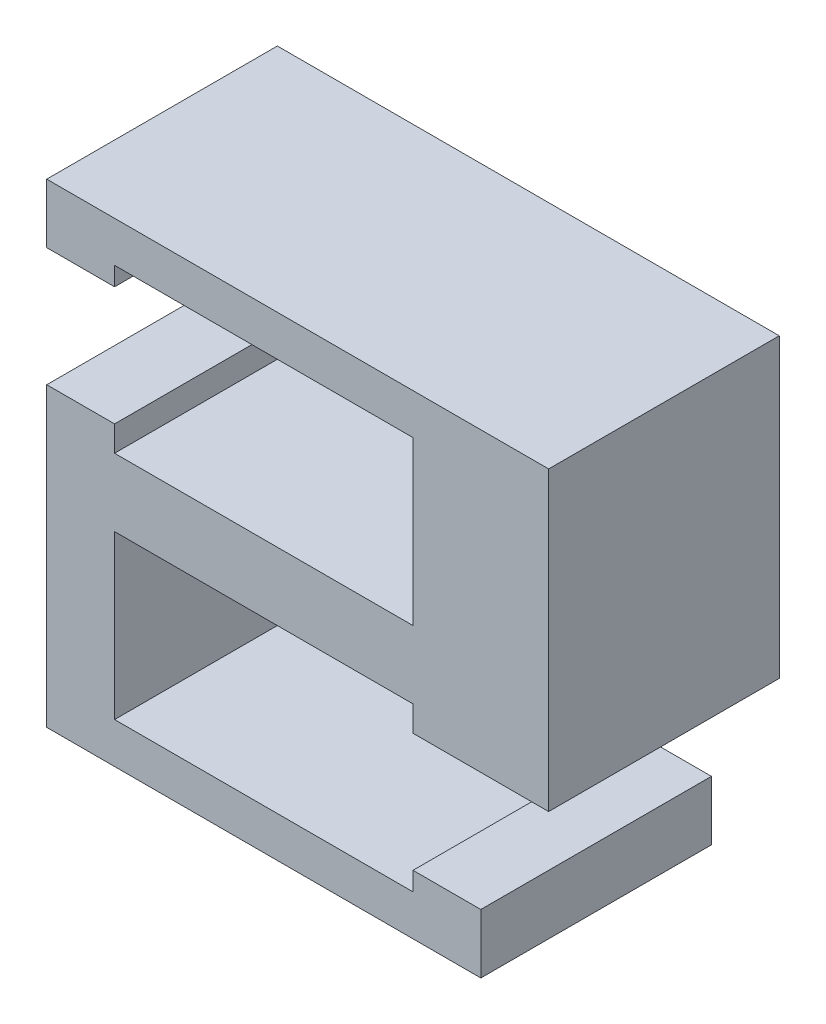
ISO-10303-21;
HEADER;
FILE_DESCRIPTION(('STEP AP214'),'2;1');
FILE_NAME('part.step','',(''),(''),'','','');
FILE_SCHEMA(('AUTOMOTIVE_DESIGN { 1 0 10303 214 1 1 1 1 }'));
ENDSEC;
DATA;
#1=APPLICATION_CONTEXT('core data for automotive mechanical design processes');
#2=APPLICATION_PROTOCOL_DEFINITION('international standard','automotive_design',2000,#1);
#3=PRODUCT_CONTEXT('',#1,'mechanical');
#4=PRODUCT('Part','Part','',(#3));
#5=PRODUCT_RELATED_PRODUCT_CATEGORY('part','',(#4));
#6=PRODUCT_DEFINITION_FORMATION('','',#4);
#7=PRODUCT_DEFINITION_CONTEXT('part definition',#1,'design');
#8=PRODUCT_DEFINITION('design','',#6,#7);
#9=PRODUCT_DEFINITION_SHAPE('','',#8);
#10=(LENGTH_UNIT() NAMED_UNIT(*) SI_UNIT(.MILLI.,.METRE.));
#11=(NAMED_UNIT(*) PLANE_ANGLE_UNIT() SI_UNIT($,.RADIAN.));
#12=(NAMED_UNIT(*) SI_UNIT($,.STERADIAN.) SOLID_ANGLE_UNIT());
#13=UNCERTAINTY_MEASURE_WITH_UNIT(LENGTH_MEASURE(1.E-05),#10,'distance_accuracy_value','');
#14=(GEOMETRIC_REPRESENTATION_CONTEXT(3) GLOBAL_UNCERTAINTY_ASSIGNED_CONTEXT((#13)) GLOBAL_UNIT_ASSIGNED_CONTEXT((#10,
#11,#12)) REPRESENTATION_CONTEXT('',''));
#15=CARTESIAN_POINT('',(0.,0.,0.));
#16=DIRECTION('',(0.,0.,1.));
#17=DIRECTION('',(1.,0.,0.));
#18=AXIS2_PLACEMENT_3D('',#15,#16,#17);
#19=CARTESIAN_POINT('',(16.1122382547684,0.,35.));
#20=DIRECTION('',(-1.,0.,0.));
#21=DIRECTION('',(0.,-1.,0.));
#22=AXIS2_PLACEMENT_3D('',#19,#20,#21);
#23=PLANE('',#22);
#24=DIRECTION('',(0.,0.,-1.));
#25=VECTOR('',#24,1.);
#26=CARTESIAN_POINT('',(16.1122382547684,40.9799365132959,35.));
#27=LINE('',#26,#25);
#28=CARTESIAN_POINT('',(16.1122382547684,40.9799365132959,32.));
#29=VERTEX_POINT('',#28);
#30=CARTESIAN_POINT('',(16.1122382547684,40.9799365132959,15.));
#31=VERTEX_POINT('',#30);
#32=EDGE_CURVE('E47',#29,#31,#27,.T.);
#33=ORIENTED_EDGE('',*,*,#32,.T.);
#34=DIRECTION('',(0.,1.,0.));
#35=VECTOR('',#34,1.);
#36=CARTESIAN_POINT('',(16.1122382547684,75.9799365132959,15.));
#37=LINE('',#36,#35);
#38=CARTESIAN_POINT('',(16.1122382547684,45.3549365132959,15.));
#39=VERTEX_POINT('',#38);
#40=EDGE_CURVE('E272',#31,#39,#37,.T.);
#41=ORIENTED_EDGE('',*,*,#40,.T.);
#42=DIRECTION('',(0.,0.,1.));
#43=VECTOR('',#42,1.);
#44=CARTESIAN_POINT('',(16.1122382547684,45.3549365132959,35.));
#45=LINE('',#44,#43);
#46=CARTESIAN_POINT('',(16.1122382547684,45.3549365132959,32.));
#47=VERTEX_POINT('',#46);
#48=EDGE_CURVE('E252',#39,#47,#45,.T.);
#49=ORIENTED_EDGE('',*,*,#48,.T.);
#50=DIRECTION('',(0.,1.,0.));
#51=VECTOR('',#50,1.);
#52=CARTESIAN_POINT('',(16.1122382547684,75.9799365132959,32.));
#53=LINE('',#52,#51);
#54=EDGE_CURVE('E210',#29,#47,#53,.T.);
#55=ORIENTED_EDGE('',*,*,#54,.F.);
#56=EDGE_LOOP('',(#33,#41,#49,#55));
#57=FACE_BOUND('',#56,.T.);
#58=ADVANCED_FACE('F39',(#57),#23,.F.);
#59=CARTESIAN_POINT('',(11.1122380163498,0.,35.));
#60=DIRECTION('',(-1.,0.,0.));
#61=DIRECTION('',(0.,0.,-1.));
#62=AXIS2_PLACEMENT_3D('',#59,#60,#61);
#63=PLANE('',#62);
#64=DIRECTION('',(0.,1.,0.));
#65=VECTOR('',#64,1.);
#66=CARTESIAN_POINT('',(11.1122380163498,0.,32.));
#67=LINE('',#66,#65);
#68=CARTESIAN_POINT('',(11.1122380163498,43.9799365132959,32.));
#69=VERTEX_POINT('',#68);
#70=CARTESIAN_POINT('',(11.1122380163498,45.3549365132959,32.));
#71=VERTEX_POINT('',#70);
#72=EDGE_CURVE('E219',#69,#71,#67,.T.);
#73=ORIENTED_EDGE('',*,*,#72,.T.);
#74=DIRECTION('',(0.,0.,1.));
#75=VECTOR('',#74,1.);
#76=CARTESIAN_POINT('',(11.1122380163498,45.3549365132959,35.));
#77=LINE('',#76,#75);
#78=CARTESIAN_POINT('',(11.1122380163498,45.3549365132959,15.));
#79=VERTEX_POINT('',#78);
#80=EDGE_CURVE('E253',#79,#71,#77,.T.);
#81=ORIENTED_EDGE('',*,*,#80,.F.);
#82=DIRECTION('',(0.,-1.,0.));
#83=VECTOR('',#82,1.);
#84=CARTESIAN_POINT('',(11.1122380163498,0.,15.));
#85=LINE('',#84,#83);
#86=CARTESIAN_POINT('',(11.1122380163498,43.9799365132959,15.));
#87=VERTEX_POINT('',#86);
#88=EDGE_CURVE('E288',#79,#87,#85,.T.);
#89=ORIENTED_EDGE('',*,*,#88,.T.);
#90=DIRECTION('',(0.,0.,-1.));
#91=VECTOR('',#90,1.);
#92=CARTESIAN_POINT('',(11.1122380163498,43.9799365132959,35.));
#93=LINE('',#92,#91);
#94=EDGE_CURVE('E329',#69,#87,#93,.T.);
#95=ORIENTED_EDGE('',*,*,#94,.F.);
#96=EDGE_LOOP('',(#73,#81,#89,#95));
#97=FACE_BOUND('',#96,.T.);
#98=ADVANCED_FACE('F355',(#97),#63,.T.);
#99=CARTESIAN_POINT('',(-10.8877619836502,0.,35.));
#100=DIRECTION('',(-1.,0.,0.));
#101=DIRECTION('',(0.,-1.,0.));
#102=AXIS2_PLACEMENT_3D('',#99,#100,#101);
#103=PLANE('',#102);
#104=DIRECTION('',(0.,0.,-1.));
#105=VECTOR('',#104,1.);
#106=CARTESIAN_POINT('',(-10.8877619836502,60.9799365132958,35.));
#107=LINE('',#106,#105);
#108=CARTESIAN_POINT('',(-10.8877619836502,60.9799365132958,32.));
#109=VERTEX_POINT('',#108);
#110=CARTESIAN_POINT('',(-10.8877619836502,60.9799365132959,15.));
#111=VERTEX_POINT('',#110);
#112=EDGE_CURVE('E318',#109,#111,#107,.T.);
#113=ORIENTED_EDGE('',*,*,#112,.T.);
#114=DIRECTION('',(0.,-1.,0.));
#115=VECTOR('',#114,1.);
#116=CARTESIAN_POINT('',(-10.8877619836502,0.,15.));
#117=LINE('',#116,#115);
#118=CARTESIAN_POINT('',(-10.8877619836502,62.8549365132958,15.));
#119=VERTEX_POINT('',#118);
#120=EDGE_CURVE('E306',#119,#111,#117,.T.);
#121=ORIENTED_EDGE('',*,*,#120,.F.);
#122=DIRECTION('',(0.,0.,-1.));
#123=VECTOR('',#122,1.);
#124=CARTESIAN_POINT('',(-10.8877619836502,62.8549365132958,15.));
#125=LINE('',#124,#123);
#126=CARTESIAN_POINT('',(-10.8877619836502,62.8549365132958,32.));
#127=VERTEX_POINT('',#126);
#128=EDGE_CURVE('E259',#127,#119,#125,.T.);
#129=ORIENTED_EDGE('',*,*,#128,.F.);
#130=DIRECTION('',(0.,1.,0.));
#131=VECTOR('',#130,1.);
#132=CARTESIAN_POINT('',(-10.8877619836502,0.,32.));
#133=LINE('',#132,#131);
#134=EDGE_CURVE('E237',#109,#127,#133,.T.);
#135=ORIENTED_EDGE('',*,*,#134,.F.);
#136=EDGE_LOOP('',(#113,#121,#129,#135));
#137=FACE_BOUND('',#136,.T.);
#138=ADVANCED_FACE('F378',(#137),#103,.F.);
#139=CARTESIAN_POINT('',(-15.8877622220688,0.,35.));
#140=DIRECTION('',(-1.,0.,0.));
#141=DIRECTION('',(0.,-1.,0.));
#142=AXIS2_PLACEMENT_3D('',#139,#140,#141);
#143=PLANE('',#142);
#144=DIRECTION('',(0.,1.,0.));
#145=VECTOR('',#144,1.);
#146=CARTESIAN_POINT('',(-15.8877622220688,75.9799365132959,32.));
#147=LINE('',#146,#145);
#148=CARTESIAN_POINT('',(-15.8877622220688,40.9799365132959,32.));
#149=VERTEX_POINT('',#148);
#150=CARTESIAN_POINT('',(-15.8877622220688,62.8549365132958,32.));
#151=VERTEX_POINT('',#150);
#152=EDGE_CURVE('E213',#149,#151,#147,.T.);
#153=ORIENTED_EDGE('',*,*,#152,.T.);
#154=DIRECTION('',(0.,0.,1.));
#155=VECTOR('',#154,1.);
#156=CARTESIAN_POINT('',(-15.8877622220688,62.8549365132958,15.));
#157=LINE('',#156,#155);
#158=CARTESIAN_POINT('',(-15.8877622220688,62.8549365132958,15.));
#159=VERTEX_POINT('',#158);
#160=EDGE_CURVE('E265',#159,#151,#157,.T.);
#161=ORIENTED_EDGE('',*,*,#160,.F.);
#162=DIRECTION('',(0.,1.,0.));
#163=VECTOR('',#162,1.);
#164=CARTESIAN_POINT('',(-15.8877622220688,75.9799365132959,15.));
#165=LINE('',#164,#163);
#166=CARTESIAN_POINT('',(-15.8877622220688,40.9799365132959,15.));
#167=VERTEX_POINT('',#166);
#168=EDGE_CURVE('E276',#167,#159,#165,.T.);
#169=ORIENTED_EDGE('',*,*,#168,.F.);
#170=DIRECTION('',(0.,0.,-1.));
#171=VECTOR('',#170,1.);
#172=CARTESIAN_POINT('',(-15.8877622220688,40.9799365132959,35.));
#173=LINE('',#172,#171);
#174=EDGE_CURVE('E313',#149,#167,#173,.T.);
#175=ORIENTED_EDGE('',*,*,#174,.F.);
#176=EDGE_LOOP('',(#153,#161,#169,#175));
#177=FACE_BOUND('',#176,.T.);
#178=ADVANCED_FACE('F368',(#177),#143,.T.);
#179=CARTESIAN_POINT('',(-15.8877622220688,75.9799365132959,15.));
#180=DIRECTION('',(0.,0.,1.));
#181=DIRECTION('',(0.,1.,0.));
#182=AXIS2_PLACEMENT_3D('',#179,#180,#181);
#183=PLANE('',#182);
#184=CARTESIAN_POINT('',(14.1122382547684,66.9799365132959,15.));
#185=DIRECTION('',(0.,0.,1.));
#186=DIRECTION('',(1.,0.,0.));
#187=AXIS2_PLACEMENT_3D('',#184,#185,#186);
#188=CIRCLE('',#187,0.999999999999961);
#189=CARTESIAN_POINT('',(15.1122382547684,66.9799365132959,15.));
#190=VERTEX_POINT('',#189);
#191=EDGE_CURVE('E200',#190,#190,#188,.T.);
#192=ORIENTED_EDGE('',*,*,#191,.T.);
#193=EDGE_LOOP('',(#192));
#194=FACE_BOUND('',#193,.T.);
#195=CARTESIAN_POINT('',(-13.8877622220688,49.9799365132959,15.));
#196=DIRECTION('',(0.,0.,1.));
#197=DIRECTION('',(1.,0.,0.));
#198=AXIS2_PLACEMENT_3D('',#195,#196,#197);
#199=CIRCLE('',#198,0.999999999999961);
#200=CARTESIAN_POINT('',(-12.8877622220688,49.9799365132959,15.));
#201=VERTEX_POINT('',#200);
#202=EDGE_CURVE('E203',#201,#201,#199,.T.);
#203=ORIENTED_EDGE('',*,*,#202,.T.);
#204=EDGE_LOOP('',(#203));
#205=FACE_BOUND('',#204,.T.);
#206=ORIENTED_EDGE('',*,*,#40,.F.);
#207=DIRECTION('',(1.,0.,0.));
#208=VECTOR('',#207,1.);
#209=CARTESIAN_POINT('',(-15.8877622220688,40.9799365132959,15.));
#210=LINE('',#209,#208);
#211=EDGE_CURVE('E282',#167,#31,#210,.T.);
#212=ORIENTED_EDGE('',*,*,#211,.F.);
#213=ORIENTED_EDGE('',*,*,#168,.T.);
#214=DIRECTION('',(-1.,0.,0.));
#215=VECTOR('',#214,1.);
#216=CARTESIAN_POINT('',(16.1132382547684,62.8549365132958,15.));
#217=LINE('',#216,#215);
#218=EDGE_CURVE('E268',#119,#159,#217,.T.);
#219=ORIENTED_EDGE('',*,*,#218,.F.);
#220=ORIENTED_EDGE('',*,*,#120,.T.);
#221=DIRECTION('',(1.,0.,0.));
#222=VECTOR('',#221,1.);
#223=CARTESIAN_POINT('',(0.,60.9799365132959,15.));
#224=LINE('',#223,#222);
#225=CARTESIAN_POINT('',(11.1122380163498,60.9799365132958,15.));
#226=VERTEX_POINT('',#225);
#227=EDGE_CURVE('E303',#111,#226,#224,.T.);
#228=ORIENTED_EDGE('',*,*,#227,.T.);
#229=DIRECTION('',(0.,-1.,0.));
#230=VECTOR('',#229,1.);
#231=CARTESIAN_POINT('',(11.1122380163498,0.,15.));
#232=LINE('',#231,#230);
#233=CARTESIAN_POINT('',(11.1122380163498,72.9799365132958,15.));
#234=VERTEX_POINT('',#233);
#235=EDGE_CURVE('E300',#234,#226,#232,.T.);
#236=ORIENTED_EDGE('',*,*,#235,.F.);
#237=DIRECTION('',(-1.,4.06395371900136E-09,0.));
#238=VECTOR('',#237,1.);
#239=CARTESIAN_POINT('',(2.96587084589218E-07,72.9799365584555,15.));
#240=LINE('',#239,#238);
#241=CARTESIAN_POINT('',(-10.8877619836502,72.9799366027028,15.));
#242=VERTEX_POINT('',#241);
#243=EDGE_CURVE('E297',#234,#242,#240,.T.);
#244=ORIENTED_EDGE('',*,*,#243,.T.);
#245=CARTESIAN_POINT('',(-10.8877619836502,71.6049365132959,15.));
#246=VERTEX_POINT('',#245);
#247=EDGE_CURVE('E307',#242,#246,#117,.T.);
#248=ORIENTED_EDGE('',*,*,#247,.T.);
#249=DIRECTION('',(-1.,0.,0.));
#250=VECTOR('',#249,1.);
#251=CARTESIAN_POINT('',(16.1132382547684,71.6049365132959,15.));
#252=LINE('',#251,#250);
#253=CARTESIAN_POINT('',(-15.8877622220688,71.6049365132959,15.));
#254=VERTEX_POINT('',#253);
#255=EDGE_CURVE('E264',#246,#254,#252,.T.);
#256=ORIENTED_EDGE('',*,*,#255,.T.);
#257=CARTESIAN_POINT('',(-15.8877622220688,75.9799365132959,15.));
#258=VERTEX_POINT('',#257);
#259=EDGE_CURVE('E279',#254,#258,#165,.T.);
#260=ORIENTED_EDGE('',*,*,#259,.T.);
#261=DIRECTION('',(1.,0.,0.));
#262=VECTOR('',#261,1.);
#263=CARTESIAN_POINT('',(-15.8877622220688,75.9799365132959,15.));
#264=LINE('',#263,#262);
#265=CARTESIAN_POINT('',(21.1122382547684,75.9799365132959,15.));
#266=VERTEX_POINT('',#265);
#267=EDGE_CURVE('E196',#258,#266,#264,.T.);
#268=ORIENTED_EDGE('',*,*,#267,.T.);
#269=DIRECTION('',(0.,-1.,0.));
#270=VECTOR('',#269,1.);
#271=CARTESIAN_POINT('',(21.1122382547684,75.9799365132959,15.));
#272=LINE('',#271,#270);
#273=CARTESIAN_POINT('',(21.1122382547684,54.1049365132959,15.));
#274=VERTEX_POINT('',#273);
#275=EDGE_CURVE('E180',#266,#274,#272,.T.);
#276=ORIENTED_EDGE('',*,*,#275,.T.);
#277=DIRECTION('',(1.,0.,0.));
#278=VECTOR('',#277,1.);
#279=CARTESIAN_POINT('',(-15.8887622220688,54.1049365132958,15.));
#280=LINE('',#279,#278);
#281=CARTESIAN_POINT('',(11.1122380163498,54.1049365132959,15.));
#282=VERTEX_POINT('',#281);
#283=EDGE_CURVE('E186',#282,#274,#280,.T.);
#284=ORIENTED_EDGE('',*,*,#283,.F.);
#285=CARTESIAN_POINT('',(11.1122380163498,55.9799365132959,15.));
#286=VERTEX_POINT('',#285);
#287=EDGE_CURVE('E289',#286,#282,#85,.T.);
#288=ORIENTED_EDGE('',*,*,#287,.F.);
#289=DIRECTION('',(-1.,0.,0.));
#290=VECTOR('',#289,1.);
#291=CARTESIAN_POINT('',(0.,55.9799365132959,15.));
#292=LINE('',#291,#290);
#293=CARTESIAN_POINT('',(-10.8877619836502,55.9799365132959,15.));
#294=VERTEX_POINT('',#293);
#295=EDGE_CURVE('E284',#286,#294,#292,.T.);
#296=ORIENTED_EDGE('',*,*,#295,.T.);
#297=DIRECTION('',(0.,-1.,0.));
#298=VECTOR('',#297,1.);
#299=CARTESIAN_POINT('',(-10.8877619836502,0.,15.));
#300=LINE('',#299,#298);
#301=CARTESIAN_POINT('',(-10.8877619836502,43.9799365132959,15.));
#302=VERTEX_POINT('',#301);
#303=EDGE_CURVE('E294',#294,#302,#300,.T.);
#304=ORIENTED_EDGE('',*,*,#303,.T.);
#305=DIRECTION('',(-1.,0.,0.));
#306=VECTOR('',#305,1.);
#307=CARTESIAN_POINT('',(0.,43.9799365132959,15.));
#308=LINE('',#307,#306);
#309=EDGE_CURVE('E291',#87,#302,#308,.T.);
#310=ORIENTED_EDGE('',*,*,#309,.F.);
#311=ORIENTED_EDGE('',*,*,#88,.F.);
#312=DIRECTION('',(1.,0.,0.));
#313=VECTOR('',#312,1.);
#314=CARTESIAN_POINT('',(-15.8887622220688,45.3549365132958,15.));
#315=LINE('',#314,#313);
#316=EDGE_CURVE('E190',#79,#39,#315,.T.);
#317=ORIENTED_EDGE('',*,*,#316,.T.);
#318=EDGE_LOOP('',(#206,#212,#213,#219,#220,#228,#236,#244,#248,#256,#260,#268,#276,#284,#288,
#296,#304,#310,#311,#317));
#319=FACE_BOUND('',#318,.T.);
#320=ADVANCED_FACE('F193',(#194,#205,#319),#183,.F.);
#321=CARTESIAN_POINT('',(0.,75.9799365132959,35.));
#322=DIRECTION('',(0.,1.,0.));
#323=DIRECTION('',(0.,0.,-1.));
#324=AXIS2_PLACEMENT_3D('',#321,#322,#323);
#325=PLANE('',#324);
#326=DIRECTION('',(-1.,0.,0.));
#327=VECTOR('',#326,1.);
#328=CARTESIAN_POINT('',(16.1122382547684,75.9799365132959,32.));
#329=LINE('',#328,#327);
#330=CARTESIAN_POINT('',(21.1122382547684,75.9799365132959,32.));
#331=VERTEX_POINT('',#330);
#332=CARTESIAN_POINT('',(-15.8877622220688,75.9799365132959,32.));
#333=VERTEX_POINT('',#332);
#334=EDGE_CURVE('E216',#331,#333,#329,.T.);
#335=ORIENTED_EDGE('',*,*,#334,.F.);
#336=DIRECTION('',(0.,0.,-1.));
#337=VECTOR('',#336,1.);
#338=CARTESIAN_POINT('',(21.1122382547684,75.9799365132959,15.));
#339=LINE('',#338,#337);
#340=EDGE_CURVE('E207',#331,#266,#339,.T.);
#341=ORIENTED_EDGE('',*,*,#340,.T.);
#342=ORIENTED_EDGE('',*,*,#267,.F.);
#343=DIRECTION('',(0.,0.,-1.));
#344=VECTOR('',#343,1.);
#345=CARTESIAN_POINT('',(-15.8877622220688,75.9799365132959,35.));
#346=LINE('',#345,#344);
#347=EDGE_CURVE('E316',#333,#258,#346,.T.);
#348=ORIENTED_EDGE('',*,*,#347,.F.);
#349=EDGE_LOOP('',(#335,#341,#342,#348));
#350=FACE_BOUND('',#349,.T.);
#351=ADVANCED_FACE('F404',(#350),#325,.T.);
#352=CARTESIAN_POINT('',(0.,40.9799365132959,35.));
#353=DIRECTION('',(0.,1.,0.));
#354=DIRECTION('',(0.,0.,-1.));
#355=AXIS2_PLACEMENT_3D('',#352,#353,#354);
#356=PLANE('',#355);
#357=ORIENTED_EDGE('',*,*,#174,.T.);
#358=ORIENTED_EDGE('',*,*,#211,.T.);
#359=ORIENTED_EDGE('',*,*,#32,.F.);
#360=DIRECTION('',(-1.,0.,0.));
#361=VECTOR('',#360,1.);
#362=CARTESIAN_POINT('',(16.1122382547684,40.9799365132959,32.));
#363=LINE('',#362,#361);
#364=EDGE_CURVE('E212',#29,#149,#363,.T.);
#365=ORIENTED_EDGE('',*,*,#364,.T.);
#366=EDGE_LOOP('',(#357,#358,#359,#365));
#367=FACE_BOUND('',#366,.T.);
#368=ADVANCED_FACE('F365',(#367),#356,.F.);
#369=DIRECTION('',(0.,0.,-1.));
#370=VECTOR('',#369,1.);
#371=CARTESIAN_POINT('',(-10.8877619836502,71.6049365132959,15.));
#372=LINE('',#371,#370);
#373=CARTESIAN_POINT('',(-10.8877619836502,71.6049365132959,32.));
#374=VERTEX_POINT('',#373);
#375=EDGE_CURVE('E263',#374,#246,#372,.T.);
#376=ORIENTED_EDGE('',*,*,#375,.T.);
#377=ORIENTED_EDGE('',*,*,#247,.F.);
#378=DIRECTION('',(0.,0.,-1.));
#379=VECTOR('',#378,1.);
#380=CARTESIAN_POINT('',(-10.8877619836502,72.9799366027028,35.));
#381=LINE('',#380,#379);
#382=CARTESIAN_POINT('',(-10.8877619836502,72.9799366027028,32.));
#383=VERTEX_POINT('',#382);
#384=EDGE_CURVE('E325',#383,#242,#381,.T.);
#385=ORIENTED_EDGE('',*,*,#384,.F.);
#386=DIRECTION('',(0.,1.,0.));
#387=VECTOR('',#386,1.);
#388=CARTESIAN_POINT('',(-10.8877619836502,0.,32.));
#389=LINE('',#388,#387);
#390=EDGE_CURVE('E247',#374,#383,#389,.T.);
#391=ORIENTED_EDGE('',*,*,#390,.F.);
#392=EDGE_LOOP('',(#376,#377,#385,#391));
#393=FACE_BOUND('',#392,.T.);
#394=ADVANCED_FACE('F393',(#393),#103,.F.);
#395=CARTESIAN_POINT('',(0.,60.9799365132959,35.));
#396=DIRECTION('',(0.,-1.,0.));
#397=DIRECTION('',(1.,0.,0.));
#398=AXIS2_PLACEMENT_3D('',#395,#396,#397);
#399=PLANE('',#398);
#400=DIRECTION('',(0.,0.,-1.));
#401=VECTOR('',#400,1.);
#402=CARTESIAN_POINT('',(11.1122380163498,60.9799365132958,35.));
#403=LINE('',#402,#401);
#404=CARTESIAN_POINT('',(11.1122380163498,60.9799365132958,32.));
#405=VERTEX_POINT('',#404);
#406=EDGE_CURVE('E321',#405,#226,#403,.T.);
#407=ORIENTED_EDGE('',*,*,#406,.T.);
#408=ORIENTED_EDGE('',*,*,#227,.F.);
#409=ORIENTED_EDGE('',*,*,#112,.F.);
#410=DIRECTION('',(-1.,0.,0.));
#411=VECTOR('',#410,1.);
#412=CARTESIAN_POINT('',(0.,60.9799365132959,32.));
#413=LINE('',#412,#411);
#414=EDGE_CURVE('E240',#405,#109,#413,.T.);
#415=ORIENTED_EDGE('',*,*,#414,.F.);
#416=EDGE_LOOP('',(#407,#408,#409,#415));
#417=FACE_BOUND('',#416,.T.);
#418=ADVANCED_FACE('F381',(#417),#399,.F.);
#419=DIRECTION('',(0.,1.,0.));
#420=VECTOR('',#419,1.);
#421=CARTESIAN_POINT('',(11.1122380163498,0.,32.));
#422=LINE('',#421,#420);
#423=CARTESIAN_POINT('',(11.1122380163498,72.9799365132958,32.));
#424=VERTEX_POINT('',#423);
#425=EDGE_CURVE('E242',#405,#424,#422,.T.);
#426=ORIENTED_EDGE('',*,*,#425,.T.);
#427=DIRECTION('',(0.,0.,-1.));
#428=VECTOR('',#427,1.);
#429=CARTESIAN_POINT('',(11.1122380163498,72.9799365132958,35.));
#430=LINE('',#429,#428);
#431=EDGE_CURVE('E323',#424,#234,#430,.T.);
#432=ORIENTED_EDGE('',*,*,#431,.T.);
#433=ORIENTED_EDGE('',*,*,#235,.T.);
#434=ORIENTED_EDGE('',*,*,#406,.F.);
#435=EDGE_LOOP('',(#426,#432,#433,#434));
#436=FACE_BOUND('',#435,.T.);
#437=ADVANCED_FACE('F384',(#436),#63,.T.);
#438=DIRECTION('',(0.,0.,-1.));
#439=VECTOR('',#438,1.);
#440=CARTESIAN_POINT('',(-10.8877619836502,43.9799365132959,35.));
#441=LINE('',#440,#439);
#442=CARTESIAN_POINT('',(-10.8877619836502,43.9799365132959,32.));
#443=VERTEX_POINT('',#442);
#444=EDGE_CURVE('E327',#443,#302,#441,.T.);
#445=ORIENTED_EDGE('',*,*,#444,.T.);
#446=ORIENTED_EDGE('',*,*,#303,.F.);
#447=DIRECTION('',(0.,0.,-1.));
#448=VECTOR('',#447,1.);
#449=CARTESIAN_POINT('',(-10.8877619836502,55.9799365132959,35.));
#450=LINE('',#449,#448);
#451=CARTESIAN_POINT('',(-10.8877619836502,55.9799365132959,32.));
#452=VERTEX_POINT('',#451);
#453=EDGE_CURVE('E310',#452,#294,#450,.T.);
#454=ORIENTED_EDGE('',*,*,#453,.F.);
#455=DIRECTION('',(0.,1.,0.));
#456=VECTOR('',#455,1.);
#457=CARTESIAN_POINT('',(-10.8877619836502,0.,32.));
#458=LINE('',#457,#456);
#459=EDGE_CURVE('E225',#443,#452,#458,.T.);
#460=ORIENTED_EDGE('',*,*,#459,.F.);
#461=EDGE_LOOP('',(#445,#446,#454,#460));
#462=FACE_BOUND('',#461,.T.);
#463=ADVANCED_FACE('F340',(#462),#103,.F.);
#464=CARTESIAN_POINT('',(0.,43.9799365132959,35.));
#465=DIRECTION('',(0.,1.,0.));
#466=DIRECTION('',(0.,0.,-1.));
#467=AXIS2_PLACEMENT_3D('',#464,#465,#466);
#468=PLANE('',#467);
#469=DIRECTION('',(1.,0.,0.));
#470=VECTOR('',#469,1.);
#471=CARTESIAN_POINT('',(0.,43.9799365132959,32.));
#472=LINE('',#471,#470);
#473=EDGE_CURVE('E223',#443,#69,#472,.T.);
#474=ORIENTED_EDGE('',*,*,#473,.T.);
#475=ORIENTED_EDGE('',*,*,#94,.T.);
#476=ORIENTED_EDGE('',*,*,#309,.T.);
#477=ORIENTED_EDGE('',*,*,#444,.F.);
#478=EDGE_LOOP('',(#474,#475,#476,#477));
#479=FACE_BOUND('',#478,.T.);
#480=ADVANCED_FACE('F348',(#479),#468,.T.);
#481=DIRECTION('',(0.,1.,0.));
#482=VECTOR('',#481,1.);
#483=CARTESIAN_POINT('',(11.1122380163498,0.,32.));
#484=LINE('',#483,#482);
#485=CARTESIAN_POINT('',(11.1122380163498,54.1049365132959,32.));
#486=VERTEX_POINT('',#485);
#487=CARTESIAN_POINT('',(11.1122380163498,55.9799365132959,32.));
#488=VERTEX_POINT('',#487);
#489=EDGE_CURVE('E230',#486,#488,#484,.T.);
#490=ORIENTED_EDGE('',*,*,#489,.T.);
#491=DIRECTION('',(0.,0.,-1.));
#492=VECTOR('',#491,1.);
#493=CARTESIAN_POINT('',(11.1122380163498,55.9799365132959,35.));
#494=LINE('',#493,#492);
#495=EDGE_CURVE('E332',#488,#286,#494,.T.);
#496=ORIENTED_EDGE('',*,*,#495,.T.);
#497=ORIENTED_EDGE('',*,*,#287,.T.);
#498=DIRECTION('',(0.,0.,-1.));
#499=VECTOR('',#498,1.);
#500=CARTESIAN_POINT('',(11.1122380163498,54.1049365132959,35.));
#501=LINE('',#500,#499);
#502=EDGE_CURVE('E60',#486,#282,#501,.T.);
#503=ORIENTED_EDGE('',*,*,#502,.F.);
#504=EDGE_LOOP('',(#490,#496,#497,#503));
#505=FACE_BOUND('',#504,.T.);
#506=ADVANCED_FACE('F343',(#505),#63,.T.);
#507=CARTESIAN_POINT('',(2.96587084589218E-07,72.9799365584555,35.));
#508=DIRECTION('',(4.06395371900136E-09,1.,0.));
#509=DIRECTION('',(-1.,4.06395371900136E-09,0.));
#510=AXIS2_PLACEMENT_3D('',#507,#508,#509);
#511=PLANE('',#510);
#512=ORIENTED_EDGE('',*,*,#384,.T.);
#513=ORIENTED_EDGE('',*,*,#243,.F.);
#514=ORIENTED_EDGE('',*,*,#431,.F.);
#515=DIRECTION('',(1.,-4.06395371900136E-09,0.));
#516=VECTOR('',#515,1.);
#517=CARTESIAN_POINT('',(2.96587084589218E-07,72.9799365584555,32.));
#518=LINE('',#517,#516);
#519=EDGE_CURVE('E245',#383,#424,#518,.T.);
#520=ORIENTED_EDGE('',*,*,#519,.F.);
#521=EDGE_LOOP('',(#512,#513,#514,#520));
#522=FACE_BOUND('',#521,.T.);
#523=ADVANCED_FACE('F389',(#522),#511,.F.);
#524=CARTESIAN_POINT('',(0.,55.9799365132959,35.));
#525=DIRECTION('',(0.,1.,0.));
#526=DIRECTION('',(0.,0.,-1.));
#527=AXIS2_PLACEMENT_3D('',#524,#525,#526);
#528=PLANE('',#527);
#529=ORIENTED_EDGE('',*,*,#453,.T.);
#530=ORIENTED_EDGE('',*,*,#295,.F.);
#531=ORIENTED_EDGE('',*,*,#495,.F.);
#532=DIRECTION('',(1.,0.,0.));
#533=VECTOR('',#532,1.);
#534=CARTESIAN_POINT('',(0.,55.9799365132959,32.));
#535=LINE('',#534,#533);
#536=EDGE_CURVE('E228',#452,#488,#535,.T.);
#537=ORIENTED_EDGE('',*,*,#536,.F.);
#538=EDGE_LOOP('',(#529,#530,#531,#537));
#539=FACE_BOUND('',#538,.T.);
#540=ADVANCED_FACE('F41',(#539),#528,.F.);
#541=CARTESIAN_POINT('',(-15.8877622220688,71.6049365132959,32.));
#542=VERTEX_POINT('',#541);
#543=EDGE_CURVE('E209',#542,#333,#147,.T.);
#544=ORIENTED_EDGE('',*,*,#543,.T.);
#545=ORIENTED_EDGE('',*,*,#347,.T.);
#546=ORIENTED_EDGE('',*,*,#259,.F.);
#547=DIRECTION('',(0.,0.,1.));
#548=VECTOR('',#547,1.);
#549=CARTESIAN_POINT('',(-15.8877622220688,71.6049365132959,15.));
#550=LINE('',#549,#548);
#551=EDGE_CURVE('E260',#254,#542,#550,.T.);
#552=ORIENTED_EDGE('',*,*,#551,.T.);
#553=EDGE_LOOP('',(#544,#545,#546,#552));
#554=FACE_BOUND('',#553,.T.);
#555=ADVANCED_FACE('F400',(#554),#143,.T.);
#556=CARTESIAN_POINT('',(16.1132382547684,71.6049365132959,15.));
#557=DIRECTION('',(0.,1.,0.));
#558=DIRECTION('',(-1.,0.,0.));
#559=AXIS2_PLACEMENT_3D('',#556,#557,#558);
#560=PLANE('',#559);
#561=ORIENTED_EDGE('',*,*,#551,.F.);
#562=ORIENTED_EDGE('',*,*,#255,.F.);
#563=ORIENTED_EDGE('',*,*,#375,.F.);
#564=DIRECTION('',(1.,0.,0.));
#565=VECTOR('',#564,1.);
#566=CARTESIAN_POINT('',(16.1132382547684,71.6049365132959,32.));
#567=LINE('',#566,#565);
#568=EDGE_CURVE('E250',#542,#374,#567,.T.);
#569=ORIENTED_EDGE('',*,*,#568,.F.);
#570=EDGE_LOOP('',(#561,#562,#563,#569));
#571=FACE_BOUND('',#570,.T.);
#572=ADVANCED_FACE('F397',(#571),#560,.F.);
#573=CARTESIAN_POINT('',(16.1132382547684,62.8549365132958,15.));
#574=DIRECTION('',(0.,1.,0.));
#575=DIRECTION('',(-1.,0.,0.));
#576=AXIS2_PLACEMENT_3D('',#573,#574,#575);
#577=PLANE('',#576);
#578=DIRECTION('',(1.,0.,0.));
#579=VECTOR('',#578,1.);
#580=CARTESIAN_POINT('',(16.1132382547684,62.8549365132958,32.));
#581=LINE('',#580,#579);
#582=EDGE_CURVE('E235',#151,#127,#581,.T.);
#583=ORIENTED_EDGE('',*,*,#582,.T.);
#584=ORIENTED_EDGE('',*,*,#128,.T.);
#585=ORIENTED_EDGE('',*,*,#218,.T.);
#586=ORIENTED_EDGE('',*,*,#160,.T.);
#587=EDGE_LOOP('',(#583,#584,#585,#586));
#588=FACE_BOUND('',#587,.T.);
#589=ADVANCED_FACE('F370',(#588),#577,.T.);
#590=CARTESIAN_POINT('',(-15.8887622220688,54.1049365132958,35.));
#591=DIRECTION('',(0.,1.,0.));
#592=DIRECTION('',(-1.,0.,0.));
#593=AXIS2_PLACEMENT_3D('',#590,#591,#592);
#594=PLANE('',#593);
#595=ORIENTED_EDGE('',*,*,#502,.T.);
#596=ORIENTED_EDGE('',*,*,#283,.T.);
#597=DIRECTION('',(0.,0.,1.));
#598=VECTOR('',#597,1.);
#599=CARTESIAN_POINT('',(21.1122382547684,54.1049365132959,15.));
#600=LINE('',#599,#598);
#601=CARTESIAN_POINT('',(21.1122382547684,54.1049365132959,32.));
#602=VERTEX_POINT('',#601);
#603=EDGE_CURVE('E176',#274,#602,#600,.T.);
#604=ORIENTED_EDGE('',*,*,#603,.T.);
#605=DIRECTION('',(1.,0.,0.));
#606=VECTOR('',#605,1.);
#607=CARTESIAN_POINT('',(-15.8887622220688,54.1049365132958,32.));
#608=LINE('',#607,#606);
#609=EDGE_CURVE('E233',#486,#602,#608,.T.);
#610=ORIENTED_EDGE('',*,*,#609,.F.);
#611=EDGE_LOOP('',(#595,#596,#604,#610));
#612=FACE_BOUND('',#611,.T.);
#613=ADVANCED_FACE('F187',(#612),#594,.F.);
#614=CARTESIAN_POINT('',(-15.8887622220688,45.3549365132958,35.));
#615=DIRECTION('',(0.,-1.,0.));
#616=DIRECTION('',(1.,0.,0.));
#617=AXIS2_PLACEMENT_3D('',#614,#615,#616);
#618=PLANE('',#617);
#619=ORIENTED_EDGE('',*,*,#48,.F.);
#620=ORIENTED_EDGE('',*,*,#316,.F.);
#621=ORIENTED_EDGE('',*,*,#80,.T.);
#622=DIRECTION('',(-1.,0.,0.));
#623=VECTOR('',#622,1.);
#624=CARTESIAN_POINT('',(-15.8887622220688,45.3549365132958,32.));
#625=LINE('',#624,#623);
#626=EDGE_CURVE('E11',#47,#71,#625,.T.);
#627=ORIENTED_EDGE('',*,*,#626,.F.);
#628=EDGE_LOOP('',(#619,#620,#621,#627));
#629=FACE_BOUND('',#628,.T.);
#630=ADVANCED_FACE('F357',(#629),#618,.F.);
#631=CARTESIAN_POINT('',(16.1122382547684,75.9799365132959,32.));
#632=DIRECTION('',(0.,0.,-1.));
#633=DIRECTION('',(0.,-1.,0.));
#634=AXIS2_PLACEMENT_3D('',#631,#632,#633);
#635=PLANE('',#634);
#636=ORIENTED_EDGE('',*,*,#543,.F.);
#637=ORIENTED_EDGE('',*,*,#568,.T.);
#638=ORIENTED_EDGE('',*,*,#390,.T.);
#639=ORIENTED_EDGE('',*,*,#519,.T.);
#640=ORIENTED_EDGE('',*,*,#425,.F.);
#641=ORIENTED_EDGE('',*,*,#414,.T.);
#642=ORIENTED_EDGE('',*,*,#134,.T.);
#643=ORIENTED_EDGE('',*,*,#582,.F.);
#644=ORIENTED_EDGE('',*,*,#152,.F.);
#645=ORIENTED_EDGE('',*,*,#364,.F.);
#646=ORIENTED_EDGE('',*,*,#54,.T.);
#647=ORIENTED_EDGE('',*,*,#626,.T.);
#648=ORIENTED_EDGE('',*,*,#72,.F.);
#649=ORIENTED_EDGE('',*,*,#473,.F.);
#650=ORIENTED_EDGE('',*,*,#459,.T.);
#651=ORIENTED_EDGE('',*,*,#536,.T.);
#652=ORIENTED_EDGE('',*,*,#489,.F.);
#653=ORIENTED_EDGE('',*,*,#609,.T.);
#654=DIRECTION('',(0.,1.,0.));
#655=VECTOR('',#654,1.);
#656=CARTESIAN_POINT('',(21.1122382547684,75.9799365132959,32.));
#657=LINE('',#656,#655);
#658=EDGE_CURVE('E182',#602,#331,#657,.T.);
#659=ORIENTED_EDGE('',*,*,#658,.T.);
#660=ORIENTED_EDGE('',*,*,#334,.T.);
#661=EDGE_LOOP('',(#636,#637,#638,#639,#640,#641,#642,#643,#644,#645,#646,#647,#648,#649,#650,
#651,#652,#653,#659,#660));
#662=FACE_BOUND('',#661,.T.);
#663=ADVANCED_FACE('F346',(#662),#635,.F.);
#664=CARTESIAN_POINT('',(21.1122382547684,0.,0.));
#665=DIRECTION('',(1.,0.,0.));
#666=DIRECTION('',(0.,1.,0.));
#667=AXIS2_PLACEMENT_3D('',#664,#665,#666);
#668=PLANE('',#667);
#669=ORIENTED_EDGE('',*,*,#275,.F.);
#670=ORIENTED_EDGE('',*,*,#340,.F.);
#671=ORIENTED_EDGE('',*,*,#658,.F.);
#672=ORIENTED_EDGE('',*,*,#603,.F.);
#673=EDGE_LOOP('',(#669,#670,#671,#672));
#674=FACE_BOUND('',#673,.T.);
#675=ADVANCED_FACE('F177',(#674),#668,.T.);
#676=CARTESIAN_POINT('',(-13.8877622220688,49.9799365132959,25.));
#677=DIRECTION('',(0.,0.,-1.));
#678=DIRECTION('',(1.,0.,0.));
#679=AXIS2_PLACEMENT_3D('',#676,#677,#678);
#680=CYLINDRICAL_SURFACE('',#679,0.999999999999961);
#681=CARTESIAN_POINT('',(-13.8877622220688,49.9799365132959,25.));
#682=DIRECTION('',(0.,0.,1.));
#683=DIRECTION('',(1.,0.,0.));
#684=AXIS2_PLACEMENT_3D('',#681,#682,#683);
#685=CIRCLE('',#684,0.999999999999961);
#686=CARTESIAN_POINT('',(-12.8877622220688,49.9799365132959,25.));
#687=VERTEX_POINT('',#686);
#688=EDGE_CURVE('E630',#687,#687,#685,.T.);
#689=ORIENTED_EDGE('',*,*,#688,.T.);
#690=EDGE_LOOP('',(#689));
#691=FACE_BOUND('',#690,.T.);
#692=ORIENTED_EDGE('',*,*,#202,.F.);
#693=EDGE_LOOP('',(#692));
#694=FACE_BOUND('',#693,.T.);
#695=ADVANCED_FACE('F579',(#691,#694),#680,.F.);
#696=CARTESIAN_POINT('',(-13.8877622220688,49.9799365132959,25.));
#697=DIRECTION('',(0.,0.,-1.));
#698=DIRECTION('',(1.,0.,0.));
#699=AXIS2_PLACEMENT_3D('',#696,#697,#698);
#700=PLANE('',#699);
#701=ORIENTED_EDGE('',*,*,#688,.F.);
#702=EDGE_LOOP('',(#701));
#703=FACE_BOUND('',#702,.T.);
#704=ADVANCED_FACE('F587',(#703),#700,.T.);
#705=CARTESIAN_POINT('',(14.1122382547684,66.9799365132959,25.));
#706=DIRECTION('',(0.,0.,-1.));
#707=DIRECTION('',(1.,0.,0.));
#708=AXIS2_PLACEMENT_3D('',#705,#706,#707);
#709=CYLINDRICAL_SURFACE('',#708,0.999999999999961);
#710=CARTESIAN_POINT('',(14.1122382547684,66.9799365132959,25.));
#711=DIRECTION('',(0.,0.,1.));
#712=DIRECTION('',(1.,0.,0.));
#713=AXIS2_PLACEMENT_3D('',#710,#711,#712);
#714=CIRCLE('',#713,0.999999999999961);
#715=CARTESIAN_POINT('',(15.1122382547684,66.9799365132959,25.));
#716=VERTEX_POINT('',#715);
#717=EDGE_CURVE('E197',#716,#716,#714,.T.);
#718=ORIENTED_EDGE('',*,*,#717,.T.);
#719=EDGE_LOOP('',(#718));
#720=FACE_BOUND('',#719,.T.);
#721=ORIENTED_EDGE('',*,*,#191,.F.);
#722=EDGE_LOOP('',(#721));
#723=FACE_BOUND('',#722,.T.);
#724=ADVANCED_FACE('F596',(#720,#723),#709,.F.);
#725=CARTESIAN_POINT('',(14.1122382547684,66.9799365132959,25.));
#726=DIRECTION('',(0.,0.,-1.));
#727=DIRECTION('',(1.,0.,0.));
#728=AXIS2_PLACEMENT_3D('',#725,#726,#727);
#729=PLANE('',#728);
#730=ORIENTED_EDGE('',*,*,#717,.F.);
#731=EDGE_LOOP('',(#730));
#732=FACE_BOUND('',#731,.T.);
#733=ADVANCED_FACE('F605',(#732),#729,.T.);
#734=CLOSED_SHELL('',(#58,#98,#138,#178,#320,#351,#368,#394,#418,#437,#463,#480,#506,#523,#540,
#555,#572,#589,#613,#630,#663,#675,#695,#704,#724,#733));
#735=MANIFOLD_SOLID_BREP('B2',#734);
#736=ADVANCED_BREP_SHAPE_REPRESENTATION('',(#18,#735),#14);
#737=SHAPE_DEFINITION_REPRESENTATION(#9,#736);
ENDSEC;
END-ISO-10303-21;
